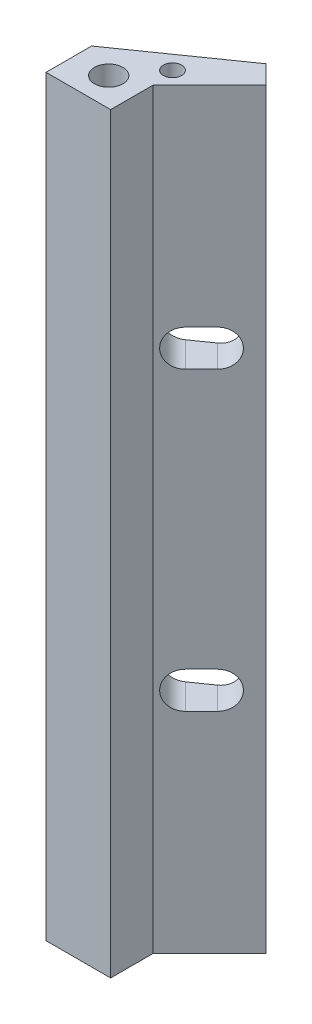
ISO-10303-21;
HEADER;
FILE_DESCRIPTION(('STEP AP214'),'2;1');
FILE_NAME('part.step','',(''),(''),'','','');
FILE_SCHEMA(('AUTOMOTIVE_DESIGN { 1 0 10303 214 1 1 1 1 }'));
ENDSEC;
DATA;
#1=APPLICATION_CONTEXT('core data for automotive mechanical design processes');
#2=APPLICATION_PROTOCOL_DEFINITION('international standard','automotive_design',2000,#1);
#3=PRODUCT_CONTEXT('',#1,'mechanical');
#4=PRODUCT('Part','Part','',(#3));
#5=PRODUCT_RELATED_PRODUCT_CATEGORY('part','',(#4));
#6=PRODUCT_DEFINITION_FORMATION('','',#4);
#7=PRODUCT_DEFINITION_CONTEXT('part definition',#1,'design');
#8=PRODUCT_DEFINITION('design','',#6,#7);
#9=PRODUCT_DEFINITION_SHAPE('','',#8);
#10=(LENGTH_UNIT() NAMED_UNIT(*) SI_UNIT(.MILLI.,.METRE.));
#11=(NAMED_UNIT(*) PLANE_ANGLE_UNIT() SI_UNIT($,.RADIAN.));
#12=(NAMED_UNIT(*) SI_UNIT($,.STERADIAN.) SOLID_ANGLE_UNIT());
#13=UNCERTAINTY_MEASURE_WITH_UNIT(LENGTH_MEASURE(1.E-05),#10,'distance_accuracy_value','');
#14=(GEOMETRIC_REPRESENTATION_CONTEXT(3) GLOBAL_UNCERTAINTY_ASSIGNED_CONTEXT((#13)) GLOBAL_UNIT_ASSIGNED_CONTEXT((#10,
#11,#12)) REPRESENTATION_CONTEXT('',''));
#15=CARTESIAN_POINT('',(0.,0.,0.));
#16=DIRECTION('',(0.,0.,1.));
#17=DIRECTION('',(1.,0.,0.));
#18=AXIS2_PLACEMENT_3D('',#15,#16,#17);
#19=CARTESIAN_POINT('',(4.6187008721053,0.,0.916833034036763));
#20=DIRECTION('',(0.707106781186548,0.,-0.707106781186548));
#21=DIRECTION('',(-0.707106781186548,0.,-0.707106781186548));
#22=AXIS2_PLACEMENT_3D('',#19,#20,#21);
#23=PLANE('',#22);
#24=DIRECTION('',(-0.707106781186548,0.,-0.707106781186548));
#25=VECTOR('',#24,1.);
#26=CARTESIAN_POINT('',(4.6187008721053,66.,0.916833034036763));
#27=LINE('',#26,#25);
#28=CARTESIAN_POINT('',(4.6187008721053,66.,0.916833034036763));
#29=VERTEX_POINT('',#28);
#30=CARTESIAN_POINT('',(2.99999999712652,66.,-0.701867840942023));
#31=VERTEX_POINT('',#30);
#32=EDGE_CURVE('E218',#29,#31,#27,.T.);
#33=ORIENTED_EDGE('',*,*,#32,.F.);
#34=DIRECTION('',(0.,1.,0.));
#35=VECTOR('',#34,1.);
#36=CARTESIAN_POINT('',(4.6187008721053,0.,0.916833034036763));
#37=LINE('',#36,#35);
#38=CARTESIAN_POINT('',(4.6187008721053,0.,0.916833034036763));
#39=VERTEX_POINT('',#38);
#40=EDGE_CURVE('E261',#39,#29,#37,.T.);
#41=ORIENTED_EDGE('',*,*,#40,.F.);
#42=DIRECTION('',(-0.707106781186548,0.,-0.707106781186548));
#43=VECTOR('',#42,1.);
#44=CARTESIAN_POINT('',(4.6187008721053,0.,0.916833034036763));
#45=LINE('',#44,#43);
#46=CARTESIAN_POINT('',(2.99999999712652,0.,-0.701867840942023));
#47=VERTEX_POINT('',#46);
#48=EDGE_CURVE('E225',#39,#47,#45,.T.);
#49=ORIENTED_EDGE('',*,*,#48,.T.);
#50=DIRECTION('',(0.,1.,0.));
#51=VECTOR('',#50,1.);
#52=CARTESIAN_POINT('',(2.99999999712652,0.,-0.701867840942023));
#53=LINE('',#52,#51);
#54=EDGE_CURVE('E244',#47,#31,#53,.T.);
#55=ORIENTED_EDGE('',*,*,#54,.T.);
#56=EDGE_LOOP('',(#33,#41,#49,#55));
#57=FACE_BOUND('',#56,.T.);
#58=ADVANCED_FACE('F33',(#57),#23,.T.);
#59=CARTESIAN_POINT('',(-0.33104659149401,0.,5.86658049763607));
#60=DIRECTION('',(0.707106781186547,0.,0.707106781186547));
#61=DIRECTION('',(0.707106781186548,0.,-0.707106781186548));
#62=AXIS2_PLACEMENT_3D('',#59,#60,#61);
#63=PLANE('',#62);
#64=CARTESIAN_POINT('',(2.49738053104314,19.999999999,3.03815337509892));
#65=DIRECTION('',(0.707106781186548,0.,0.707106781186548));
#66=DIRECTION('',(0.707106781186548,0.,-0.707106781186548));
#67=AXIS2_PLACEMENT_3D('',#64,#65,#66);
#68=CIRCLE('',#67,1.59999999207179);
#69=CARTESIAN_POINT('',(2.49738053104314,18.4000000069282,3.03815337509892));
#70=VERTEX_POINT('',#69);
#71=CARTESIAN_POINT('',(2.49738053104314,21.5999999910718,3.03815337509892));
#72=VERTEX_POINT('',#71);
#73=EDGE_CURVE('E47',#70,#72,#68,.T.);
#74=ORIENTED_EDGE('',*,*,#73,.F.);
#75=DIRECTION('',(0.707106781186547,0.,-0.707106781186548));
#76=VECTOR('',#75,1.);
#77=CARTESIAN_POINT('',(1.08316696903882,18.4000000069282,4.45236693710325));
#78=LINE('',#77,#76);
#79=CARTESIAN_POINT('',(1.08316696903882,18.4000000069282,4.45236693710325));
#80=VERTEX_POINT('',#79);
#81=EDGE_CURVE('E191',#80,#70,#78,.T.);
#82=ORIENTED_EDGE('',*,*,#81,.F.);
#83=CARTESIAN_POINT('',(1.08316696903882,19.999999999,4.45236693710325));
#84=DIRECTION('',(0.707106781186548,0.,0.707106781186548));
#85=DIRECTION('',(0.707106781186548,0.,-0.707106781186548));
#86=AXIS2_PLACEMENT_3D('',#83,#84,#85);
#87=CIRCLE('',#86,1.59999999207179);
#88=CARTESIAN_POINT('',(1.08316696903882,21.5999999910718,4.45236693710325));
#89=VERTEX_POINT('',#88);
#90=EDGE_CURVE('E188',#89,#80,#87,.T.);
#91=ORIENTED_EDGE('',*,*,#90,.F.);
#92=DIRECTION('',(-0.707106781186547,0.,0.707106781186548));
#93=VECTOR('',#92,1.);
#94=CARTESIAN_POINT('',(2.49738053104314,21.5999999910718,3.03815337509892));
#95=LINE('',#94,#93);
#96=EDGE_CURVE('E186',#72,#89,#95,.T.);
#97=ORIENTED_EDGE('',*,*,#96,.F.);
#98=EDGE_LOOP('',(#74,#82,#91,#97));
#99=FACE_BOUND('',#98,.T.);
#100=CARTESIAN_POINT('',(2.49738053104315,46.000000001,3.03815337509892));
#101=DIRECTION('',(0.707106781186548,0.,0.707106781186548));
#102=DIRECTION('',(0.707106781186548,0.,-0.707106781186548));
#103=AXIS2_PLACEMENT_3D('',#100,#101,#102);
#104=CIRCLE('',#103,1.59999999207178);
#105=CARTESIAN_POINT('',(2.49738053104315,44.4000000089282,3.03815337509892));
#106=VERTEX_POINT('',#105);
#107=CARTESIAN_POINT('',(2.49738053104315,47.5999999930718,3.03815337509892));
#108=VERTEX_POINT('',#107);
#109=EDGE_CURVE('E204',#106,#108,#104,.T.);
#110=ORIENTED_EDGE('',*,*,#109,.F.);
#111=DIRECTION('',(0.707106781186547,0.,-0.707106781186548));
#112=VECTOR('',#111,1.);
#113=CARTESIAN_POINT('',(1.08316696903882,44.4000000089282,4.45236693710325));
#114=LINE('',#113,#112);
#115=CARTESIAN_POINT('',(1.08316696903882,44.4000000089282,4.45236693710325));
#116=VERTEX_POINT('',#115);
#117=EDGE_CURVE('E212',#116,#106,#114,.T.);
#118=ORIENTED_EDGE('',*,*,#117,.F.);
#119=CARTESIAN_POINT('',(1.08316696903882,46.000000001,4.45236693710325));
#120=DIRECTION('',(0.707106781186548,0.,0.707106781186548));
#121=DIRECTION('',(0.707106781186548,0.,-0.707106781186548));
#122=AXIS2_PLACEMENT_3D('',#119,#120,#121);
#123=CIRCLE('',#122,1.59999999207178);
#124=CARTESIAN_POINT('',(1.08316696903882,47.5999999930718,4.45236693710325));
#125=VERTEX_POINT('',#124);
#126=EDGE_CURVE('E209',#125,#116,#123,.T.);
#127=ORIENTED_EDGE('',*,*,#126,.F.);
#128=DIRECTION('',(-0.707106781186547,0.,0.707106781186548));
#129=VECTOR('',#128,1.);
#130=CARTESIAN_POINT('',(2.49738053104315,47.5999999930718,3.03815337509892));
#131=LINE('',#130,#129);
#132=EDGE_CURVE('E206',#108,#125,#131,.T.);
#133=ORIENTED_EDGE('',*,*,#132,.F.);
#134=EDGE_LOOP('',(#110,#118,#127,#133));
#135=FACE_BOUND('',#134,.T.);
#136=DIRECTION('',(0.707106781186547,0.,-0.707106781186547));
#137=VECTOR('',#136,1.);
#138=CARTESIAN_POINT('',(-0.33104659149401,66.,5.86658049763607));
#139=LINE('',#138,#137);
#140=CARTESIAN_POINT('',(-0.33104659149401,66.,5.86658049763607));
#141=VERTEX_POINT('',#140);
#142=EDGE_CURVE('E229',#141,#29,#139,.T.);
#143=ORIENTED_EDGE('',*,*,#142,.F.);
#144=DIRECTION('',(0.,1.,0.));
#145=VECTOR('',#144,1.);
#146=CARTESIAN_POINT('',(-0.33104659149401,0.,5.86658049763607));
#147=LINE('',#146,#145);
#148=CARTESIAN_POINT('',(-0.33104659149401,0.,5.86658049763607));
#149=VERTEX_POINT('',#148);
#150=EDGE_CURVE('E264',#149,#141,#147,.T.);
#151=ORIENTED_EDGE('',*,*,#150,.F.);
#152=DIRECTION('',(0.707106781186547,0.,-0.707106781186547));
#153=VECTOR('',#152,1.);
#154=CARTESIAN_POINT('',(-0.33104659149401,0.,5.86658049763607));
#155=LINE('',#154,#153);
#156=EDGE_CURVE('E241',#149,#39,#155,.T.);
#157=ORIENTED_EDGE('',*,*,#156,.T.);
#158=ORIENTED_EDGE('',*,*,#40,.T.);
#159=EDGE_LOOP('',(#143,#151,#157,#158));
#160=FACE_BOUND('',#159,.T.);
#161=ADVANCED_FACE('F299',(#99,#135,#160),#63,.T.);
#162=CARTESIAN_POINT('',(-0.33104659149401,0.,9.6));
#163=DIRECTION('',(1.,0.,0.));
#164=DIRECTION('',(0.,0.,-1.));
#165=AXIS2_PLACEMENT_3D('',#162,#163,#164);
#166=PLANE('',#165);
#167=DIRECTION('',(0.,0.,-1.));
#168=VECTOR('',#167,1.);
#169=CARTESIAN_POINT('',(-0.33104659149401,66.,9.6));
#170=LINE('',#169,#168);
#171=CARTESIAN_POINT('',(-0.33104659149401,66.,9.6));
#172=VERTEX_POINT('',#171);
#173=EDGE_CURVE('E256',#172,#141,#170,.T.);
#174=ORIENTED_EDGE('',*,*,#173,.F.);
#175=DIRECTION('',(0.,1.,0.));
#176=VECTOR('',#175,1.);
#177=CARTESIAN_POINT('',(-0.33104659149401,0.,9.6));
#178=LINE('',#177,#176);
#179=CARTESIAN_POINT('',(-0.33104659149401,0.,9.6));
#180=VERTEX_POINT('',#179);
#181=EDGE_CURVE('E266',#180,#172,#178,.T.);
#182=ORIENTED_EDGE('',*,*,#181,.F.);
#183=DIRECTION('',(0.,0.,-1.));
#184=VECTOR('',#183,1.);
#185=CARTESIAN_POINT('',(-0.33104659149401,0.,9.6));
#186=LINE('',#185,#184);
#187=EDGE_CURVE('E238',#180,#149,#186,.T.);
#188=ORIENTED_EDGE('',*,*,#187,.T.);
#189=ORIENTED_EDGE('',*,*,#150,.T.);
#190=EDGE_LOOP('',(#174,#182,#188,#189));
#191=FACE_BOUND('',#190,.T.);
#192=ADVANCED_FACE('F302',(#191),#166,.T.);
#193=CARTESIAN_POINT('',(-6.,0.,9.6));
#194=DIRECTION('',(0.,0.,1.));
#195=DIRECTION('',(1.,0.,0.));
#196=AXIS2_PLACEMENT_3D('',#193,#194,#195);
#197=PLANE('',#196);
#198=DIRECTION('',(1.,0.,0.));
#199=VECTOR('',#198,1.);
#200=CARTESIAN_POINT('',(-6.,66.,9.6));
#201=LINE('',#200,#199);
#202=CARTESIAN_POINT('',(-6.,66.,9.6));
#203=VERTEX_POINT('',#202);
#204=EDGE_CURVE('E253',#203,#172,#201,.T.);
#205=ORIENTED_EDGE('',*,*,#204,.F.);
#206=DIRECTION('',(0.,1.,0.));
#207=VECTOR('',#206,1.);
#208=CARTESIAN_POINT('',(-6.,0.,9.6));
#209=LINE('',#208,#207);
#210=CARTESIAN_POINT('',(-6.,0.,9.6));
#211=VERTEX_POINT('',#210);
#212=EDGE_CURVE('E268',#211,#203,#209,.T.);
#213=ORIENTED_EDGE('',*,*,#212,.F.);
#214=DIRECTION('',(1.,0.,0.));
#215=VECTOR('',#214,1.);
#216=CARTESIAN_POINT('',(-6.,0.,9.6));
#217=LINE('',#216,#215);
#218=EDGE_CURVE('E235',#211,#180,#217,.T.);
#219=ORIENTED_EDGE('',*,*,#218,.T.);
#220=ORIENTED_EDGE('',*,*,#181,.T.);
#221=EDGE_LOOP('',(#205,#213,#219,#220));
#222=FACE_BOUND('',#221,.T.);
#223=ADVANCED_FACE('F326',(#222),#197,.T.);
#224=CARTESIAN_POINT('',(-6.,0.,5.59999999748528));
#225=DIRECTION('',(-1.,0.,0.));
#226=DIRECTION('',(0.,0.,1.));
#227=AXIS2_PLACEMENT_3D('',#224,#225,#226);
#228=PLANE('',#227);
#229=DIRECTION('',(0.,0.,1.));
#230=VECTOR('',#229,1.);
#231=CARTESIAN_POINT('',(-6.,66.,5.59999999748528));
#232=LINE('',#231,#230);
#233=CARTESIAN_POINT('',(-6.,66.,5.59999999748528));
#234=VERTEX_POINT('',#233);
#235=EDGE_CURVE('E250',#234,#203,#232,.T.);
#236=ORIENTED_EDGE('',*,*,#235,.F.);
#237=DIRECTION('',(0.,1.,0.));
#238=VECTOR('',#237,1.);
#239=CARTESIAN_POINT('',(-6.,0.,5.59999999748528));
#240=LINE('',#239,#238);
#241=CARTESIAN_POINT('',(-6.,0.,5.59999999748528));
#242=VERTEX_POINT('',#241);
#243=EDGE_CURVE('E270',#242,#234,#240,.T.);
#244=ORIENTED_EDGE('',*,*,#243,.F.);
#245=DIRECTION('',(0.,0.,1.));
#246=VECTOR('',#245,1.);
#247=CARTESIAN_POINT('',(-6.,0.,5.59999999748528));
#248=LINE('',#247,#246);
#249=EDGE_CURVE('E232',#242,#211,#248,.T.);
#250=ORIENTED_EDGE('',*,*,#249,.T.);
#251=ORIENTED_EDGE('',*,*,#212,.T.);
#252=EDGE_LOOP('',(#236,#244,#250,#251));
#253=FACE_BOUND('',#252,.T.);
#254=ADVANCED_FACE('F324',(#253),#228,.T.);
#255=CARTESIAN_POINT('',(2.99999999712652,0.,-0.701867840942023));
#256=DIRECTION('',(-0.573576436140462,0.,-0.819152044436444));
#257=DIRECTION('',(-0.819152044436444,0.,0.573576436140462));
#258=AXIS2_PLACEMENT_3D('',#255,#256,#257);
#259=PLANE('',#258);
#260=CARTESIAN_POINT('',(0.504633644647122,19.999999999,1.0454064887029));
#261=DIRECTION('',(-0.573576436140462,0.,-0.819152044436444));
#262=DIRECTION('',(0.819152044436444,0.,-0.573576436140462));
#263=AXIS2_PLACEMENT_3D('',#260,#261,#262);
#264=ELLIPSE('',#263,1.62468257104032,1.59999999207179);
#265=CARTESIAN_POINT('',(0.504633644647122,18.4000000069282,1.0454064887029));
#266=VERTEX_POINT('',#265);
#267=CARTESIAN_POINT('',(0.504633644647121,21.5999999910718,1.0454064887029));
#268=VERTEX_POINT('',#267);
#269=EDGE_CURVE('E182',#266,#268,#264,.F.);
#270=ORIENTED_EDGE('',*,*,#269,.T.);
#271=DIRECTION('',(-0.819152044436444,0.,0.573576436140462));
#272=VECTOR('',#271,1.);
#273=CARTESIAN_POINT('',(-0.32555994335472,21.5999999910718,1.62671429687709));
#274=LINE('',#273,#272);
#275=CARTESIAN_POINT('',(-1.15894392519726,21.5999999910718,2.21025604286718));
#276=VERTEX_POINT('',#275);
#277=EDGE_CURVE('E197',#268,#276,#274,.T.);
#278=ORIENTED_EDGE('',*,*,#277,.T.);
#279=CARTESIAN_POINT('',(-1.15894392519726,19.999999999,2.21025604286718));
#280=DIRECTION('',(-0.573576436140462,0.,-0.819152044436444));
#281=DIRECTION('',(0.819152044436444,0.,-0.573576436140462));
#282=AXIS2_PLACEMENT_3D('',#279,#280,#281);
#283=ELLIPSE('',#282,1.62468257104032,1.59999999207179);
#284=CARTESIAN_POINT('',(-1.15894392519726,18.4000000069282,2.21025604286718));
#285=VERTEX_POINT('',#284);
#286=EDGE_CURVE('E176',#276,#285,#283,.F.);
#287=ORIENTED_EDGE('',*,*,#286,.T.);
#288=DIRECTION('',(0.819152044436444,0.,-0.573576436140462));
#289=VECTOR('',#288,1.);
#290=CARTESIAN_POINT('',(-1.9389745113745,18.4000000069282,2.75643933904378));
#291=LINE('',#290,#289);
#292=EDGE_CURVE('E179',#285,#266,#291,.T.);
#293=ORIENTED_EDGE('',*,*,#292,.T.);
#294=EDGE_LOOP('',(#270,#278,#287,#293));
#295=FACE_BOUND('',#294,.T.);
#296=CARTESIAN_POINT('',(0.504633644647123,46.000000001,1.0454064887029));
#297=DIRECTION('',(-0.573576436140462,0.,-0.819152044436444));
#298=DIRECTION('',(0.819152044436444,0.,-0.573576436140462));
#299=AXIS2_PLACEMENT_3D('',#296,#297,#298);
#300=ELLIPSE('',#299,1.62468257104031,1.59999999207178);
#301=CARTESIAN_POINT('',(0.504633644647122,47.5999999930718,1.0454064887029));
#302=VERTEX_POINT('',#301);
#303=CARTESIAN_POINT('',(0.504633644647121,44.4000000089282,1.0454064887029));
#304=VERTEX_POINT('',#303);
#305=EDGE_CURVE('E11',#302,#304,#300,.T.);
#306=ORIENTED_EDGE('',*,*,#305,.F.);
#307=DIRECTION('',(0.819152044436444,0.,-0.573576436140462));
#308=VECTOR('',#307,1.);
#309=CARTESIAN_POINT('',(2.99999999712652,47.5999999930718,-0.701867840942023));
#310=LINE('',#309,#308);
#311=CARTESIAN_POINT('',(-1.15894392519726,47.5999999930718,2.21025604286718));
#312=VERTEX_POINT('',#311);
#313=EDGE_CURVE('E263',#312,#302,#310,.T.);
#314=ORIENTED_EDGE('',*,*,#313,.F.);
#315=CARTESIAN_POINT('',(-1.15894392519725,46.000000001,2.21025604286718));
#316=DIRECTION('',(-0.573576436140462,0.,-0.819152044436444));
#317=DIRECTION('',(0.819152044436444,0.,-0.573576436140462));
#318=AXIS2_PLACEMENT_3D('',#315,#316,#317);
#319=ELLIPSE('',#318,1.62468257104032,1.59999999207178);
#320=CARTESIAN_POINT('',(-1.15894392519725,44.4000000089282,2.21025604286718));
#321=VERTEX_POINT('',#320);
#322=EDGE_CURVE('E274',#321,#312,#319,.T.);
#323=ORIENTED_EDGE('',*,*,#322,.F.);
#324=DIRECTION('',(-0.819152044436444,0.,0.573576436140462));
#325=VECTOR('',#324,1.);
#326=CARTESIAN_POINT('',(2.99999999712627,44.4000000089283,-0.701867840941849));
#327=LINE('',#326,#325);
#328=EDGE_CURVE('E40',#304,#321,#327,.T.);
#329=ORIENTED_EDGE('',*,*,#328,.F.);
#330=EDGE_LOOP('',(#306,#314,#323,#329));
#331=FACE_BOUND('',#330,.T.);
#332=DIRECTION('',(-0.819152044436444,0.,0.573576436140462));
#333=VECTOR('',#332,1.);
#334=CARTESIAN_POINT('',(2.99999999712652,66.,-0.701867840942023));
#335=LINE('',#334,#333);
#336=EDGE_CURVE('E247',#31,#234,#335,.T.);
#337=ORIENTED_EDGE('',*,*,#336,.F.);
#338=ORIENTED_EDGE('',*,*,#54,.F.);
#339=DIRECTION('',(-0.819152044436444,0.,0.573576436140462));
#340=VECTOR('',#339,1.);
#341=CARTESIAN_POINT('',(2.99999999712652,0.,-0.701867840942023));
#342=LINE('',#341,#340);
#343=EDGE_CURVE('E228',#47,#242,#342,.T.);
#344=ORIENTED_EDGE('',*,*,#343,.T.);
#345=ORIENTED_EDGE('',*,*,#243,.T.);
#346=EDGE_LOOP('',(#337,#338,#344,#345));
#347=FACE_BOUND('',#346,.T.);
#348=ADVANCED_FACE('F289',(#295,#331,#347),#259,.T.);
#349=CARTESIAN_POINT('',(0.,0.,0.));
#350=DIRECTION('',(0.,-1.,0.));
#351=DIRECTION('',(0.,0.,-1.));
#352=AXIS2_PLACEMENT_3D('',#349,#350,#351);
#353=PLANE('',#352);
#354=CARTESIAN_POINT('',(-0.604004818,0.,3.897000298));
#355=DIRECTION('',(0.,-1.,0.));
#356=DIRECTION('',(0.,0.,-1.));
#357=AXIS2_PLACEMENT_3D('',#354,#355,#356);
#358=CIRCLE('',#357,0.799999999999999);
#359=CARTESIAN_POINT('',(-0.604004818,0.,3.097000298));
#360=VERTEX_POINT('',#359);
#361=EDGE_CURVE('E164',#360,#360,#358,.T.);
#362=ORIENTED_EDGE('',*,*,#361,.F.);
#363=EDGE_LOOP('',(#362));
#364=FACE_BOUND('',#363,.T.);
#365=CARTESIAN_POINT('',(-3.,0.,7.1));
#366=DIRECTION('',(0.,-1.,0.));
#367=DIRECTION('',(0.,0.,-1.));
#368=AXIS2_PLACEMENT_3D('',#365,#366,#367);
#369=CIRCLE('',#368,1.24999999999999);
#370=CARTESIAN_POINT('',(-3.,0.,5.85000000000001));
#371=VERTEX_POINT('',#370);
#372=EDGE_CURVE('E170',#371,#371,#369,.T.);
#373=ORIENTED_EDGE('',*,*,#372,.F.);
#374=EDGE_LOOP('',(#373));
#375=FACE_BOUND('',#374,.T.);
#376=ORIENTED_EDGE('',*,*,#48,.F.);
#377=ORIENTED_EDGE('',*,*,#156,.F.);
#378=ORIENTED_EDGE('',*,*,#187,.F.);
#379=ORIENTED_EDGE('',*,*,#218,.F.);
#380=ORIENTED_EDGE('',*,*,#249,.F.);
#381=ORIENTED_EDGE('',*,*,#343,.F.);
#382=EDGE_LOOP('',(#376,#377,#378,#379,#380,#381));
#383=FACE_BOUND('',#382,.T.);
#384=ADVANCED_FACE('F317',(#364,#375,#383),#353,.T.);
#385=CARTESIAN_POINT('',(0.,66.,0.));
#386=DIRECTION('',(0.,-1.,0.));
#387=DIRECTION('',(0.,0.,-1.));
#388=AXIS2_PLACEMENT_3D('',#385,#386,#387);
#389=PLANE('',#388);
#390=CARTESIAN_POINT('',(-0.604004818,66.,3.897000298));
#391=DIRECTION('',(0.,1.,0.));
#392=DIRECTION('',(0.,0.,1.));
#393=AXIS2_PLACEMENT_3D('',#390,#391,#392);
#394=CIRCLE('',#393,0.799999999999999);
#395=CARTESIAN_POINT('',(-0.604004818,66.,4.697000298));
#396=VERTEX_POINT('',#395);
#397=EDGE_CURVE('E154',#396,#396,#394,.T.);
#398=ORIENTED_EDGE('',*,*,#397,.F.);
#399=EDGE_LOOP('',(#398));
#400=FACE_BOUND('',#399,.T.);
#401=CARTESIAN_POINT('',(-3.,66.,7.1));
#402=DIRECTION('',(0.,1.,0.));
#403=DIRECTION('',(0.,0.,1.));
#404=AXIS2_PLACEMENT_3D('',#401,#402,#403);
#405=CIRCLE('',#404,1.24999999999999);
#406=CARTESIAN_POINT('',(-3.,66.,8.34999999999999));
#407=VERTEX_POINT('',#406);
#408=EDGE_CURVE('E153',#407,#407,#405,.T.);
#409=ORIENTED_EDGE('',*,*,#408,.F.);
#410=EDGE_LOOP('',(#409));
#411=FACE_BOUND('',#410,.T.);
#412=ORIENTED_EDGE('',*,*,#32,.T.);
#413=ORIENTED_EDGE('',*,*,#336,.T.);
#414=ORIENTED_EDGE('',*,*,#235,.T.);
#415=ORIENTED_EDGE('',*,*,#204,.T.);
#416=ORIENTED_EDGE('',*,*,#173,.T.);
#417=ORIENTED_EDGE('',*,*,#142,.T.);
#418=EDGE_LOOP('',(#412,#413,#414,#415,#416,#417));
#419=FACE_BOUND('',#418,.T.);
#420=ADVANCED_FACE('F308',(#400,#411,#419),#389,.F.);
#421=CARTESIAN_POINT('',(-3.6213203424989,46.000000001,-3.08054749844312));
#422=DIRECTION('',(0.707106781186548,0.,0.707106781186548));
#423=DIRECTION('',(0.707106781186548,0.,-0.707106781186548));
#424=AXIS2_PLACEMENT_3D('',#421,#422,#423);
#425=CYLINDRICAL_SURFACE('',#424,1.59999999207178);
#426=ORIENTED_EDGE('',*,*,#305,.T.);
#427=DIRECTION('',(0.707106781186548,0.,0.707106781186548));
#428=VECTOR('',#427,1.);
#429=CARTESIAN_POINT('',(-3.6213203424989,44.4000000089282,-3.08054749844312));
#430=LINE('',#429,#428);
#431=EDGE_CURVE('E216',#304,#106,#430,.T.);
#432=ORIENTED_EDGE('',*,*,#431,.T.);
#433=ORIENTED_EDGE('',*,*,#109,.T.);
#434=DIRECTION('',(0.707106781186548,0.,0.707106781186548));
#435=VECTOR('',#434,1.);
#436=CARTESIAN_POINT('',(-3.6213203424989,47.5999999930718,-3.08054749844312));
#437=LINE('',#436,#435);
#438=EDGE_CURVE('E215',#302,#108,#437,.T.);
#439=ORIENTED_EDGE('',*,*,#438,.F.);
#440=EDGE_LOOP('',(#426,#432,#433,#439));
#441=FACE_BOUND('',#440,.T.);
#442=ADVANCED_FACE('F296',(#441),#425,.F.);
#443=CARTESIAN_POINT('',(-5.03553390450323,44.4000000089282,-1.6663339364388));
#444=DIRECTION('',(0.,-1.,0.));
#445=DIRECTION('',(0.,0.,-1.));
#446=AXIS2_PLACEMENT_3D('',#443,#444,#445);
#447=PLANE('',#446);
#448=ORIENTED_EDGE('',*,*,#328,.T.);
#449=DIRECTION('',(0.707106781186548,0.,0.707106781186548));
#450=VECTOR('',#449,1.);
#451=CARTESIAN_POINT('',(-5.03553390450323,44.4000000089282,-1.6663339364388));
#452=LINE('',#451,#450);
#453=EDGE_CURVE('E219',#321,#116,#452,.T.);
#454=ORIENTED_EDGE('',*,*,#453,.T.);
#455=ORIENTED_EDGE('',*,*,#117,.T.);
#456=ORIENTED_EDGE('',*,*,#431,.F.);
#457=EDGE_LOOP('',(#448,#454,#455,#456));
#458=FACE_BOUND('',#457,.T.);
#459=ADVANCED_FACE('F280',(#458),#447,.F.);
#460=CARTESIAN_POINT('',(-5.03553390450323,46.000000001,-1.6663339364388));
#461=DIRECTION('',(0.707106781186548,0.,0.707106781186548));
#462=DIRECTION('',(0.707106781186548,0.,-0.707106781186548));
#463=AXIS2_PLACEMENT_3D('',#460,#461,#462);
#464=CYLINDRICAL_SURFACE('',#463,1.59999999207178);
#465=ORIENTED_EDGE('',*,*,#322,.T.);
#466=DIRECTION('',(0.707106781186548,0.,0.707106781186548));
#467=VECTOR('',#466,1.);
#468=CARTESIAN_POINT('',(-5.03553390450323,47.5999999930718,-1.6663339364388));
#469=LINE('',#468,#467);
#470=EDGE_CURVE('E221',#312,#125,#469,.T.);
#471=ORIENTED_EDGE('',*,*,#470,.T.);
#472=ORIENTED_EDGE('',*,*,#126,.T.);
#473=ORIENTED_EDGE('',*,*,#453,.F.);
#474=EDGE_LOOP('',(#465,#471,#472,#473));
#475=FACE_BOUND('',#474,.T.);
#476=ADVANCED_FACE('F285',(#475),#464,.F.);
#477=CARTESIAN_POINT('',(-3.6213203424989,47.5999999930718,-3.08054749844312));
#478=DIRECTION('',(0.,1.,0.));
#479=DIRECTION('',(0.,0.,1.));
#480=AXIS2_PLACEMENT_3D('',#477,#478,#479);
#481=PLANE('',#480);
#482=ORIENTED_EDGE('',*,*,#313,.T.);
#483=ORIENTED_EDGE('',*,*,#438,.T.);
#484=ORIENTED_EDGE('',*,*,#132,.T.);
#485=ORIENTED_EDGE('',*,*,#470,.F.);
#486=EDGE_LOOP('',(#482,#483,#484,#485));
#487=FACE_BOUND('',#486,.T.);
#488=ADVANCED_FACE('F293',(#487),#481,.F.);
#489=CARTESIAN_POINT('',(-3.6223203424989,19.999999999,-3.08154749844312));
#490=DIRECTION('',(0.707106781186548,0.,0.707106781186548));
#491=DIRECTION('',(0.707106781186548,0.,-0.707106781186548));
#492=AXIS2_PLACEMENT_3D('',#489,#490,#491);
#493=CYLINDRICAL_SURFACE('',#492,1.59999999207179);
#494=DIRECTION('',(0.707106781186548,0.,0.707106781186548));
#495=VECTOR('',#494,1.);
#496=CARTESIAN_POINT('',(-3.6223203424989,18.4000000069282,-3.08154749844312));
#497=LINE('',#496,#495);
#498=EDGE_CURVE('E195',#266,#70,#497,.T.);
#499=ORIENTED_EDGE('',*,*,#498,.T.);
#500=ORIENTED_EDGE('',*,*,#73,.T.);
#501=DIRECTION('',(0.707106781186548,0.,0.707106781186548));
#502=VECTOR('',#501,1.);
#503=CARTESIAN_POINT('',(-3.6223203424989,21.5999999910718,-3.08154749844312));
#504=LINE('',#503,#502);
#505=EDGE_CURVE('E194',#268,#72,#504,.T.);
#506=ORIENTED_EDGE('',*,*,#505,.F.);
#507=ORIENTED_EDGE('',*,*,#269,.F.);
#508=EDGE_LOOP('',(#499,#500,#506,#507));
#509=FACE_BOUND('',#508,.T.);
#510=ADVANCED_FACE('F393',(#509),#493,.F.);
#511=CARTESIAN_POINT('',(-5.03653390450323,18.4000000069282,-1.66733393643879));
#512=DIRECTION('',(0.,-1.,0.));
#513=DIRECTION('',(0.,0.,-1.));
#514=AXIS2_PLACEMENT_3D('',#511,#512,#513);
#515=PLANE('',#514);
#516=DIRECTION('',(0.707106781186548,0.,0.707106781186548));
#517=VECTOR('',#516,1.);
#518=CARTESIAN_POINT('',(-5.03653390450323,18.4000000069282,-1.66733393643879));
#519=LINE('',#518,#517);
#520=EDGE_CURVE('E198',#285,#80,#519,.T.);
#521=ORIENTED_EDGE('',*,*,#520,.T.);
#522=ORIENTED_EDGE('',*,*,#81,.T.);
#523=ORIENTED_EDGE('',*,*,#498,.F.);
#524=ORIENTED_EDGE('',*,*,#292,.F.);
#525=EDGE_LOOP('',(#521,#522,#523,#524));
#526=FACE_BOUND('',#525,.T.);
#527=ADVANCED_FACE('F403',(#526),#515,.F.);
#528=CARTESIAN_POINT('',(-5.03653390450323,19.999999999,-1.66733393643879));
#529=DIRECTION('',(0.707106781186548,0.,0.707106781186548));
#530=DIRECTION('',(0.707106781186548,0.,-0.707106781186548));
#531=AXIS2_PLACEMENT_3D('',#528,#529,#530);
#532=CYLINDRICAL_SURFACE('',#531,1.59999999207179);
#533=DIRECTION('',(0.707106781186548,0.,0.707106781186548));
#534=VECTOR('',#533,1.);
#535=CARTESIAN_POINT('',(-5.03653390450323,21.5999999910718,-1.66733393643879));
#536=LINE('',#535,#534);
#537=EDGE_CURVE('E55',#276,#89,#536,.T.);
#538=ORIENTED_EDGE('',*,*,#537,.T.);
#539=ORIENTED_EDGE('',*,*,#90,.T.);
#540=ORIENTED_EDGE('',*,*,#520,.F.);
#541=ORIENTED_EDGE('',*,*,#286,.F.);
#542=EDGE_LOOP('',(#538,#539,#540,#541));
#543=FACE_BOUND('',#542,.T.);
#544=ADVANCED_FACE('F409',(#543),#532,.F.);
#545=CARTESIAN_POINT('',(-3.6223203424989,21.5999999910718,-3.08154749844312));
#546=DIRECTION('',(0.,1.,0.));
#547=DIRECTION('',(0.,0.,1.));
#548=AXIS2_PLACEMENT_3D('',#545,#546,#547);
#549=PLANE('',#548);
#550=ORIENTED_EDGE('',*,*,#505,.T.);
#551=ORIENTED_EDGE('',*,*,#96,.T.);
#552=ORIENTED_EDGE('',*,*,#537,.F.);
#553=ORIENTED_EDGE('',*,*,#277,.F.);
#554=EDGE_LOOP('',(#550,#551,#552,#553));
#555=FACE_BOUND('',#554,.T.);
#556=ADVANCED_FACE('F417',(#555),#549,.F.);
#557=CARTESIAN_POINT('',(-3.,7.99999999999999,7.1));
#558=DIRECTION('',(0.,-1.,0.));
#559=DIRECTION('',(0.,0.,-1.));
#560=AXIS2_PLACEMENT_3D('',#557,#558,#559);
#561=CONICAL_SURFACE('',#560,1.24999999999999,1.02974425854995);
#562=CARTESIAN_POINT('',(-3.,8.751075774,7.1));
#563=VERTEX_POINT('',#562);
#564=VERTEX_LOOP('',#563);
#565=FACE_BOUND('',#564,.T.);
#566=CARTESIAN_POINT('',(-3.,7.99999999999999,7.1));
#567=DIRECTION('',(0.,-1.,0.));
#568=DIRECTION('',(0.,0.,-1.));
#569=AXIS2_PLACEMENT_3D('',#566,#567,#568);
#570=CIRCLE('',#569,1.24999999999999);
#571=CARTESIAN_POINT('',(-3.,7.99999999999999,5.85000000000001));
#572=VERTEX_POINT('',#571);
#573=EDGE_CURVE('E173',#572,#572,#570,.T.);
#574=ORIENTED_EDGE('',*,*,#573,.T.);
#575=EDGE_LOOP('',(#574));
#576=FACE_BOUND('',#575,.T.);
#577=ADVANCED_FACE('F425',(#565,#576),#561,.F.);
#578=CARTESIAN_POINT('',(-3.,0.,7.1));
#579=DIRECTION('',(0.,-1.,0.));
#580=DIRECTION('',(0.,0.,-1.));
#581=AXIS2_PLACEMENT_3D('',#578,#579,#580);
#582=CYLINDRICAL_SURFACE('',#581,1.24999999999999);
#583=ORIENTED_EDGE('',*,*,#573,.F.);
#584=EDGE_LOOP('',(#583));
#585=FACE_BOUND('',#584,.T.);
#586=ORIENTED_EDGE('',*,*,#372,.T.);
#587=EDGE_LOOP('',(#586));
#588=FACE_BOUND('',#587,.T.);
#589=ADVANCED_FACE('F432',(#585,#588),#582,.F.);
#590=CARTESIAN_POINT('',(-0.604004818,8.,3.897000298));
#591=DIRECTION('',(0.,-1.,0.));
#592=DIRECTION('',(0.,0.,-1.));
#593=AXIS2_PLACEMENT_3D('',#590,#591,#592);
#594=CONICAL_SURFACE('',#593,0.799999999999998,1.02974425867665);
#595=CARTESIAN_POINT('',(-0.604004818000002,8.48068849522205,3.897000298));
#596=VERTEX_POINT('',#595);
#597=VERTEX_LOOP('',#596);
#598=FACE_BOUND('',#597,.T.);
#599=CARTESIAN_POINT('',(-0.604004818,8.,3.897000298));
#600=DIRECTION('',(0.,-1.,0.));
#601=DIRECTION('',(0.,0.,-1.));
#602=AXIS2_PLACEMENT_3D('',#599,#600,#601);
#603=CIRCLE('',#602,0.799999999999998);
#604=CARTESIAN_POINT('',(-0.604004818,8.,3.097000298));
#605=VERTEX_POINT('',#604);
#606=EDGE_CURVE('E167',#605,#605,#603,.T.);
#607=ORIENTED_EDGE('',*,*,#606,.T.);
#608=EDGE_LOOP('',(#607));
#609=FACE_BOUND('',#608,.T.);
#610=ADVANCED_FACE('F440',(#598,#609),#594,.F.);
#611=CARTESIAN_POINT('',(-0.604004818,0.,3.897000298));
#612=DIRECTION('',(0.,-1.,0.));
#613=DIRECTION('',(0.,0.,-1.));
#614=AXIS2_PLACEMENT_3D('',#611,#612,#613);
#615=CYLINDRICAL_SURFACE('',#614,0.799999999999998);
#616=ORIENTED_EDGE('',*,*,#606,.F.);
#617=EDGE_LOOP('',(#616));
#618=FACE_BOUND('',#617,.T.);
#619=ORIENTED_EDGE('',*,*,#361,.T.);
#620=EDGE_LOOP('',(#619));
#621=FACE_BOUND('',#620,.T.);
#622=ADVANCED_FACE('F449',(#618,#621),#615,.F.);
#623=CARTESIAN_POINT('',(-3.,58.,7.1));
#624=DIRECTION('',(0.,1.,0.));
#625=DIRECTION('',(0.,0.,1.));
#626=AXIS2_PLACEMENT_3D('',#623,#624,#625);
#627=CONICAL_SURFACE('',#626,1.24999999999999,1.02974425854995);
#628=CARTESIAN_POINT('',(-3.,57.248924226,7.1));
#629=VERTEX_POINT('',#628);
#630=VERTEX_LOOP('',#629);
#631=FACE_BOUND('',#630,.T.);
#632=CARTESIAN_POINT('',(-3.,58.,7.1));
#633=DIRECTION('',(0.,1.,0.));
#634=DIRECTION('',(0.,0.,1.));
#635=AXIS2_PLACEMENT_3D('',#632,#633,#634);
#636=CIRCLE('',#635,1.24999999999999);
#637=CARTESIAN_POINT('',(-3.,58.,8.34999999999999));
#638=VERTEX_POINT('',#637);
#639=EDGE_CURVE('E157',#638,#638,#636,.T.);
#640=ORIENTED_EDGE('',*,*,#639,.T.);
#641=EDGE_LOOP('',(#640));
#642=FACE_BOUND('',#641,.T.);
#643=ADVANCED_FACE('F457',(#631,#642),#627,.F.);
#644=CARTESIAN_POINT('',(-3.,66.,7.1));
#645=DIRECTION('',(0.,1.,0.));
#646=DIRECTION('',(0.,0.,1.));
#647=AXIS2_PLACEMENT_3D('',#644,#645,#646);
#648=CYLINDRICAL_SURFACE('',#647,1.24999999999999);
#649=ORIENTED_EDGE('',*,*,#639,.F.);
#650=EDGE_LOOP('',(#649));
#651=FACE_BOUND('',#650,.T.);
#652=ORIENTED_EDGE('',*,*,#408,.T.);
#653=EDGE_LOOP('',(#652));
#654=FACE_BOUND('',#653,.T.);
#655=ADVANCED_FACE('F147',(#651,#654),#648,.F.);
#656=CARTESIAN_POINT('',(-0.604004818,58.,3.897000298));
#657=DIRECTION('',(0.,1.,0.));
#658=DIRECTION('',(0.,0.,1.));
#659=AXIS2_PLACEMENT_3D('',#656,#657,#658);
#660=CONICAL_SURFACE('',#659,0.799999999999998,1.02974425867665);
#661=CARTESIAN_POINT('',(-0.604004818000002,57.519311504778,3.897000298));
#662=VERTEX_POINT('',#661);
#663=VERTEX_LOOP('',#662);
#664=FACE_BOUND('',#663,.T.);
#665=CARTESIAN_POINT('',(-0.604004818,58.,3.897000298));
#666=DIRECTION('',(0.,1.,0.));
#667=DIRECTION('',(0.,0.,1.));
#668=AXIS2_PLACEMENT_3D('',#665,#666,#667);
#669=CIRCLE('',#668,0.799999999999998);
#670=CARTESIAN_POINT('',(-0.604004818,58.,4.697000298));
#671=VERTEX_POINT('',#670);
#672=EDGE_CURVE('E151',#671,#671,#669,.T.);
#673=ORIENTED_EDGE('',*,*,#672,.T.);
#674=EDGE_LOOP('',(#673));
#675=FACE_BOUND('',#674,.T.);
#676=ADVANCED_FACE('F143',(#664,#675),#660,.F.);
#677=CARTESIAN_POINT('',(-0.604004818,66.,3.897000298));
#678=DIRECTION('',(0.,1.,0.));
#679=DIRECTION('',(0.,0.,1.));
#680=AXIS2_PLACEMENT_3D('',#677,#678,#679);
#681=CYLINDRICAL_SURFACE('',#680,0.799999999999998);
#682=ORIENTED_EDGE('',*,*,#672,.F.);
#683=EDGE_LOOP('',(#682));
#684=FACE_BOUND('',#683,.T.);
#685=ORIENTED_EDGE('',*,*,#397,.T.);
#686=EDGE_LOOP('',(#685));
#687=FACE_BOUND('',#686,.T.);
#688=ADVANCED_FACE('F146',(#684,#687),#681,.F.);
#689=CLOSED_SHELL('',(#58,#161,#192,#223,#254,#348,#384,#420,#442,#459,#476,#488,#510,#527,#544,
#556,#577,#589,#610,#622,#643,#655,#676,#688));
#690=MANIFOLD_SOLID_BREP('B2',#689);
#691=ADVANCED_BREP_SHAPE_REPRESENTATION('',(#18,#690),#14);
#692=SHAPE_DEFINITION_REPRESENTATION(#9,#691);
ENDSEC;
END-ISO-10303-21;
